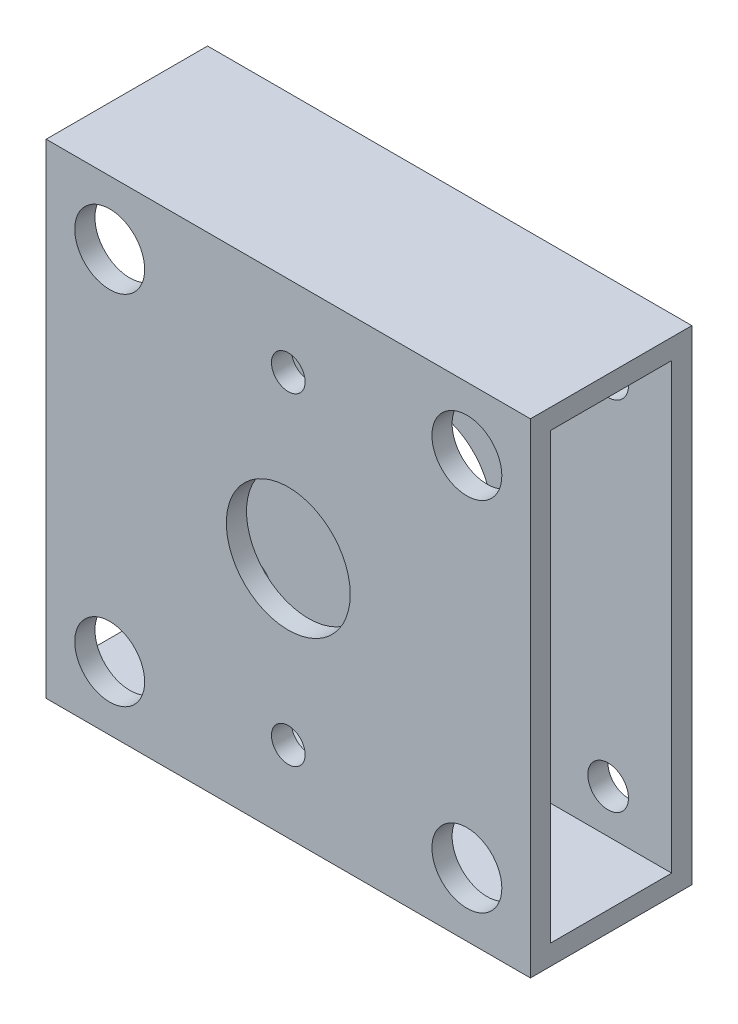
ISO-10303-21;
HEADER;
FILE_DESCRIPTION(('STEP AP214'),'2;1');
FILE_NAME('part.step','',(''),(''),'','','');
FILE_SCHEMA(('AUTOMOTIVE_DESIGN { 1 0 10303 214 1 1 1 1 }'));
ENDSEC;
DATA;
#1=APPLICATION_CONTEXT('core data for automotive mechanical design processes');
#2=APPLICATION_PROTOCOL_DEFINITION('international standard','automotive_design',2000,#1);
#3=PRODUCT_CONTEXT('',#1,'mechanical');
#4=PRODUCT('Part','Part','',(#3));
#5=PRODUCT_RELATED_PRODUCT_CATEGORY('part','',(#4));
#6=PRODUCT_DEFINITION_FORMATION('','',#4);
#7=PRODUCT_DEFINITION_CONTEXT('part definition',#1,'design');
#8=PRODUCT_DEFINITION('design','',#6,#7);
#9=PRODUCT_DEFINITION_SHAPE('','',#8);
#10=(LENGTH_UNIT() NAMED_UNIT(*) SI_UNIT(.MILLI.,.METRE.));
#11=(NAMED_UNIT(*) PLANE_ANGLE_UNIT() SI_UNIT($,.RADIAN.));
#12=(NAMED_UNIT(*) SI_UNIT($,.STERADIAN.) SOLID_ANGLE_UNIT());
#13=UNCERTAINTY_MEASURE_WITH_UNIT(LENGTH_MEASURE(1.E-05),#10,'distance_accuracy_value','');
#14=(GEOMETRIC_REPRESENTATION_CONTEXT(3) GLOBAL_UNCERTAINTY_ASSIGNED_CONTEXT((#13)) GLOBAL_UNIT_ASSIGNED_CONTEXT((#10,
#11,#12)) REPRESENTATION_CONTEXT('',''));
#15=CARTESIAN_POINT('',(0.,0.,0.));
#16=DIRECTION('',(0.,0.,1.));
#17=DIRECTION('',(1.,0.,0.));
#18=AXIS2_PLACEMENT_3D('',#15,#16,#17);
#19=CARTESIAN_POINT('',(38.1,-38.1,12.7));
#20=DIRECTION('',(-1.,0.,0.));
#21=DIRECTION('',(0.,0.,1.));
#22=AXIS2_PLACEMENT_3D('',#19,#20,#21);
#23=PLANE('',#22);
#24=DIRECTION('',(0.,1.,0.));
#25=VECTOR('',#24,1.);
#26=CARTESIAN_POINT('',(38.1,-34.925,-9.525));
#27=LINE('',#26,#25);
#28=CARTESIAN_POINT('',(38.1,-34.925,-9.525));
#29=VERTEX_POINT('',#28);
#30=CARTESIAN_POINT('',(38.1,34.925,-9.525));
#31=VERTEX_POINT('',#30);
#32=EDGE_CURVE('E130',#29,#31,#27,.T.);
#33=ORIENTED_EDGE('',*,*,#32,.F.);
#34=DIRECTION('',(0.,0.,-1.));
#35=VECTOR('',#34,1.);
#36=CARTESIAN_POINT('',(38.1,-34.925,9.525));
#37=LINE('',#36,#35);
#38=CARTESIAN_POINT('',(38.1,-34.925,9.525));
#39=VERTEX_POINT('',#38);
#40=EDGE_CURVE('E50',#39,#29,#37,.T.);
#41=ORIENTED_EDGE('',*,*,#40,.F.);
#42=DIRECTION('',(0.,-1.,0.));
#43=VECTOR('',#42,1.);
#44=CARTESIAN_POINT('',(38.1,34.925,9.525));
#45=LINE('',#44,#43);
#46=CARTESIAN_POINT('',(38.1,34.925,9.525));
#47=VERTEX_POINT('',#46);
#48=EDGE_CURVE('E118',#47,#39,#45,.T.);
#49=ORIENTED_EDGE('',*,*,#48,.F.);
#50=DIRECTION('',(0.,0.,1.));
#51=VECTOR('',#50,1.);
#52=CARTESIAN_POINT('',(38.1,34.925,-9.525));
#53=LINE('',#52,#51);
#54=EDGE_CURVE('E121',#31,#47,#53,.T.);
#55=ORIENTED_EDGE('',*,*,#54,.F.);
#56=EDGE_LOOP('',(#33,#41,#49,#55));
#57=FACE_BOUND('',#56,.T.);
#58=DIRECTION('',(0.,1.,0.));
#59=VECTOR('',#58,1.);
#60=CARTESIAN_POINT('',(38.1,-38.1,-12.7));
#61=LINE('',#60,#59);
#62=CARTESIAN_POINT('',(38.1,-38.1,-12.7));
#63=VERTEX_POINT('',#62);
#64=CARTESIAN_POINT('',(38.1,38.1,-12.7));
#65=VERTEX_POINT('',#64);
#66=EDGE_CURVE('E136',#63,#65,#61,.T.);
#67=ORIENTED_EDGE('',*,*,#66,.T.);
#68=DIRECTION('',(0.,0.,-1.));
#69=VECTOR('',#68,1.);
#70=CARTESIAN_POINT('',(38.1,38.1,12.7));
#71=LINE('',#70,#69);
#72=CARTESIAN_POINT('',(38.1,38.1,12.7));
#73=VERTEX_POINT('',#72);
#74=EDGE_CURVE('E11',#73,#65,#71,.T.);
#75=ORIENTED_EDGE('',*,*,#74,.F.);
#76=DIRECTION('',(0.,1.,0.));
#77=VECTOR('',#76,1.);
#78=CARTESIAN_POINT('',(38.1,-38.1,12.7));
#79=LINE('',#78,#77);
#80=CARTESIAN_POINT('',(38.1,-38.1,12.7));
#81=VERTEX_POINT('',#80);
#82=EDGE_CURVE('E140',#81,#73,#79,.T.);
#83=ORIENTED_EDGE('',*,*,#82,.F.);
#84=DIRECTION('',(0.,0.,-1.));
#85=VECTOR('',#84,1.);
#86=CARTESIAN_POINT('',(38.1,-38.1,12.7));
#87=LINE('',#86,#85);
#88=EDGE_CURVE('E150',#81,#63,#87,.T.);
#89=ORIENTED_EDGE('',*,*,#88,.T.);
#90=EDGE_LOOP('',(#67,#75,#83,#89));
#91=FACE_BOUND('',#90,.T.);
#92=ADVANCED_FACE('F34',(#57,#91),#23,.F.);
#93=CARTESIAN_POINT('',(-38.1,38.1,12.7));
#94=DIRECTION('',(0.,-1.,0.));
#95=DIRECTION('',(0.,0.,-1.));
#96=AXIS2_PLACEMENT_3D('',#93,#94,#95);
#97=PLANE('',#96);
#98=DIRECTION('',(-1.,0.,0.));
#99=VECTOR('',#98,1.);
#100=CARTESIAN_POINT('',(-38.1,38.1,-12.7));
#101=LINE('',#100,#99);
#102=CARTESIAN_POINT('',(-38.1,38.1,-12.7));
#103=VERTEX_POINT('',#102);
#104=EDGE_CURVE('E153',#65,#103,#101,.T.);
#105=ORIENTED_EDGE('',*,*,#104,.T.);
#106=DIRECTION('',(0.,0.,-1.));
#107=VECTOR('',#106,1.);
#108=CARTESIAN_POINT('',(-38.1,38.1,12.7));
#109=LINE('',#108,#107);
#110=CARTESIAN_POINT('',(-38.1,38.1,12.7));
#111=VERTEX_POINT('',#110);
#112=EDGE_CURVE('E42',#111,#103,#109,.T.);
#113=ORIENTED_EDGE('',*,*,#112,.F.);
#114=DIRECTION('',(-1.,0.,0.));
#115=VECTOR('',#114,1.);
#116=CARTESIAN_POINT('',(-38.1,38.1,12.7));
#117=LINE('',#116,#115);
#118=EDGE_CURVE('E143',#73,#111,#117,.T.);
#119=ORIENTED_EDGE('',*,*,#118,.F.);
#120=ORIENTED_EDGE('',*,*,#74,.T.);
#121=EDGE_LOOP('',(#105,#113,#119,#120));
#122=FACE_BOUND('',#121,.T.);
#123=ADVANCED_FACE('F264',(#122),#97,.F.);
#124=CARTESIAN_POINT('',(-38.1,-38.1,12.7));
#125=DIRECTION('',(1.,0.,0.));
#126=DIRECTION('',(0.,0.,-1.));
#127=AXIS2_PLACEMENT_3D('',#124,#125,#126);
#128=PLANE('',#127);
#129=DIRECTION('',(0.,-1.,0.));
#130=VECTOR('',#129,1.);
#131=CARTESIAN_POINT('',(-38.1,34.925,9.525));
#132=LINE('',#131,#130);
#133=CARTESIAN_POINT('',(-38.1,34.925,9.525));
#134=VERTEX_POINT('',#133);
#135=CARTESIAN_POINT('',(-38.1,-34.925,9.525));
#136=VERTEX_POINT('',#135);
#137=EDGE_CURVE('E108',#134,#136,#132,.T.);
#138=ORIENTED_EDGE('',*,*,#137,.T.);
#139=DIRECTION('',(0.,0.,-1.));
#140=VECTOR('',#139,1.);
#141=CARTESIAN_POINT('',(-38.1,-34.925,9.525));
#142=LINE('',#141,#140);
#143=CARTESIAN_POINT('',(-38.1,-34.925,-9.525));
#144=VERTEX_POINT('',#143);
#145=EDGE_CURVE('E102',#136,#144,#142,.T.);
#146=ORIENTED_EDGE('',*,*,#145,.T.);
#147=DIRECTION('',(0.,1.,0.));
#148=VECTOR('',#147,1.);
#149=CARTESIAN_POINT('',(-38.1,-34.925,-9.525));
#150=LINE('',#149,#148);
#151=CARTESIAN_POINT('',(-38.1,34.925,-9.525));
#152=VERTEX_POINT('',#151);
#153=EDGE_CURVE('E111',#144,#152,#150,.T.);
#154=ORIENTED_EDGE('',*,*,#153,.T.);
#155=DIRECTION('',(0.,0.,1.));
#156=VECTOR('',#155,1.);
#157=CARTESIAN_POINT('',(-38.1,34.925,-9.525));
#158=LINE('',#157,#156);
#159=EDGE_CURVE('E58',#152,#134,#158,.T.);
#160=ORIENTED_EDGE('',*,*,#159,.T.);
#161=EDGE_LOOP('',(#138,#146,#154,#160));
#162=FACE_BOUND('',#161,.T.);
#163=DIRECTION('',(0.,-1.,0.));
#164=VECTOR('',#163,1.);
#165=CARTESIAN_POINT('',(-38.1,-38.1,-12.7));
#166=LINE('',#165,#164);
#167=CARTESIAN_POINT('',(-38.1,-38.1,-12.7));
#168=VERTEX_POINT('',#167);
#169=EDGE_CURVE('E155',#103,#168,#166,.T.);
#170=ORIENTED_EDGE('',*,*,#169,.T.);
#171=DIRECTION('',(0.,0.,-1.));
#172=VECTOR('',#171,1.);
#173=CARTESIAN_POINT('',(-38.1,-38.1,12.7));
#174=LINE('',#173,#172);
#175=CARTESIAN_POINT('',(-38.1,-38.1,12.7));
#176=VERTEX_POINT('',#175);
#177=EDGE_CURVE('E160',#176,#168,#174,.T.);
#178=ORIENTED_EDGE('',*,*,#177,.F.);
#179=DIRECTION('',(0.,-1.,0.));
#180=VECTOR('',#179,1.);
#181=CARTESIAN_POINT('',(-38.1,-38.1,12.7));
#182=LINE('',#181,#180);
#183=EDGE_CURVE('E146',#111,#176,#182,.T.);
#184=ORIENTED_EDGE('',*,*,#183,.F.);
#185=ORIENTED_EDGE('',*,*,#112,.T.);
#186=EDGE_LOOP('',(#170,#178,#184,#185));
#187=FACE_BOUND('',#186,.T.);
#188=ADVANCED_FACE('F115',(#162,#187),#128,.F.);
#189=CARTESIAN_POINT('',(-38.1,-38.1,12.7));
#190=DIRECTION('',(0.,1.,0.));
#191=DIRECTION('',(0.,0.,1.));
#192=AXIS2_PLACEMENT_3D('',#189,#190,#191);
#193=PLANE('',#192);
#194=DIRECTION('',(1.,0.,0.));
#195=VECTOR('',#194,1.);
#196=CARTESIAN_POINT('',(-38.1,-38.1,-12.7));
#197=LINE('',#196,#195);
#198=EDGE_CURVE('E144',#168,#63,#197,.T.);
#199=ORIENTED_EDGE('',*,*,#198,.T.);
#200=ORIENTED_EDGE('',*,*,#88,.F.);
#201=DIRECTION('',(1.,0.,0.));
#202=VECTOR('',#201,1.);
#203=CARTESIAN_POINT('',(-38.1,-38.1,12.7));
#204=LINE('',#203,#202);
#205=EDGE_CURVE('E148',#176,#81,#204,.T.);
#206=ORIENTED_EDGE('',*,*,#205,.F.);
#207=ORIENTED_EDGE('',*,*,#177,.T.);
#208=EDGE_LOOP('',(#199,#200,#206,#207));
#209=FACE_BOUND('',#208,.T.);
#210=ADVANCED_FACE('F254',(#209),#193,.F.);
#211=CARTESIAN_POINT('',(0.,0.,12.7));
#212=DIRECTION('',(0.,0.,-1.));
#213=DIRECTION('',(-1.,0.,0.));
#214=AXIS2_PLACEMENT_3D('',#211,#212,#213);
#215=PLANE('',#214);
#216=CARTESIAN_POINT('',(0.,-25.4,12.7));
#217=DIRECTION('',(0.,0.,-1.));
#218=DIRECTION('',(-1.,0.,0.));
#219=AXIS2_PLACEMENT_3D('',#216,#217,#218);
#220=CIRCLE('',#219,2.64999999999999);
#221=CARTESIAN_POINT('',(-2.64999999999999,-25.4,12.7));
#222=VERTEX_POINT('',#221);
#223=EDGE_CURVE('E210',#222,#222,#220,.T.);
#224=ORIENTED_EDGE('',*,*,#223,.T.);
#225=EDGE_LOOP('',(#224));
#226=FACE_BOUND('',#225,.T.);
#227=CARTESIAN_POINT('',(0.,25.4,12.7));
#228=DIRECTION('',(0.,0.,-1.));
#229=DIRECTION('',(-1.,0.,0.));
#230=AXIS2_PLACEMENT_3D('',#227,#228,#229);
#231=CIRCLE('',#230,2.64999999999999);
#232=CARTESIAN_POINT('',(-2.64999999999999,25.4,12.7));
#233=VERTEX_POINT('',#232);
#234=EDGE_CURVE('E205',#233,#233,#231,.T.);
#235=ORIENTED_EDGE('',*,*,#234,.T.);
#236=EDGE_LOOP('',(#235));
#237=FACE_BOUND('',#236,.T.);
#238=CARTESIAN_POINT('',(-28.1,28.1,12.7));
#239=DIRECTION('',(0.,0.,1.));
#240=DIRECTION('',(1.,0.,0.));
#241=AXIS2_PLACEMENT_3D('',#238,#239,#240);
#242=CIRCLE('',#241,5.5);
#243=CARTESIAN_POINT('',(-22.6,28.1,12.7));
#244=VERTEX_POINT('',#243);
#245=EDGE_CURVE('E207',#244,#244,#242,.T.);
#246=ORIENTED_EDGE('',*,*,#245,.F.);
#247=EDGE_LOOP('',(#246));
#248=FACE_BOUND('',#247,.T.);
#249=CARTESIAN_POINT('',(28.1,28.1,12.7));
#250=DIRECTION('',(0.,0.,1.));
#251=DIRECTION('',(1.,0.,0.));
#252=AXIS2_PLACEMENT_3D('',#249,#250,#251);
#253=CIRCLE('',#252,5.5);
#254=CARTESIAN_POINT('',(33.6,28.1,12.7));
#255=VERTEX_POINT('',#254);
#256=EDGE_CURVE('E200',#255,#255,#253,.T.);
#257=ORIENTED_EDGE('',*,*,#256,.F.);
#258=EDGE_LOOP('',(#257));
#259=FACE_BOUND('',#258,.T.);
#260=CARTESIAN_POINT('',(28.1,-28.1,12.7));
#261=DIRECTION('',(0.,0.,1.));
#262=DIRECTION('',(1.,0.,0.));
#263=AXIS2_PLACEMENT_3D('',#260,#261,#262);
#264=CIRCLE('',#263,5.5);
#265=CARTESIAN_POINT('',(33.6,-28.1,12.7));
#266=VERTEX_POINT('',#265);
#267=EDGE_CURVE('E192',#266,#266,#264,.T.);
#268=ORIENTED_EDGE('',*,*,#267,.F.);
#269=EDGE_LOOP('',(#268));
#270=FACE_BOUND('',#269,.T.);
#271=CARTESIAN_POINT('',(-28.1,-28.1,12.7));
#272=DIRECTION('',(0.,0.,1.));
#273=DIRECTION('',(1.,0.,0.));
#274=AXIS2_PLACEMENT_3D('',#271,#272,#273);
#275=CIRCLE('',#274,5.5);
#276=CARTESIAN_POINT('',(-22.6,-28.1,12.7));
#277=VERTEX_POINT('',#276);
#278=EDGE_CURVE('E184',#277,#277,#275,.T.);
#279=ORIENTED_EDGE('',*,*,#278,.F.);
#280=EDGE_LOOP('',(#279));
#281=FACE_BOUND('',#280,.T.);
#282=CARTESIAN_POINT('',(0.,0.,12.7));
#283=DIRECTION('',(0.,0.,1.));
#284=DIRECTION('',(1.,0.,0.));
#285=AXIS2_PLACEMENT_3D('',#282,#283,#284);
#286=CIRCLE('',#285,9.75);
#287=CARTESIAN_POINT('',(9.75,0.,12.7));
#288=VERTEX_POINT('',#287);
#289=EDGE_CURVE('E176',#288,#288,#286,.T.);
#290=ORIENTED_EDGE('',*,*,#289,.F.);
#291=EDGE_LOOP('',(#290));
#292=FACE_BOUND('',#291,.T.);
#293=ORIENTED_EDGE('',*,*,#82,.T.);
#294=ORIENTED_EDGE('',*,*,#118,.T.);
#295=ORIENTED_EDGE('',*,*,#183,.T.);
#296=ORIENTED_EDGE('',*,*,#205,.T.);
#297=EDGE_LOOP('',(#293,#294,#295,#296));
#298=FACE_BOUND('',#297,.T.);
#299=ADVANCED_FACE('F250',(#226,#237,#248,#259,#270,#281,#292,#298),#215,.F.);
#300=CARTESIAN_POINT('',(0.,0.,-12.7));
#301=DIRECTION('',(0.,0.,-1.));
#302=DIRECTION('',(-1.,0.,0.));
#303=AXIS2_PLACEMENT_3D('',#300,#301,#302);
#304=PLANE('',#303);
#305=CARTESIAN_POINT('',(0.,-25.4,-12.7));
#306=DIRECTION('',(0.,0.,-1.));
#307=DIRECTION('',(-1.,0.,0.));
#308=AXIS2_PLACEMENT_3D('',#305,#306,#307);
#309=CIRCLE('',#308,5.);
#310=CARTESIAN_POINT('',(-5.,-25.4,-12.7));
#311=VERTEX_POINT('',#310);
#312=EDGE_CURVE('E216',#311,#311,#309,.T.);
#313=ORIENTED_EDGE('',*,*,#312,.F.);
#314=EDGE_LOOP('',(#313));
#315=FACE_BOUND('',#314,.T.);
#316=CARTESIAN_POINT('',(0.,25.4,-12.7));
#317=DIRECTION('',(0.,0.,-1.));
#318=DIRECTION('',(-1.,0.,0.));
#319=AXIS2_PLACEMENT_3D('',#316,#317,#318);
#320=CIRCLE('',#319,5.);
#321=CARTESIAN_POINT('',(-5.,25.4,-12.7));
#322=VERTEX_POINT('',#321);
#323=EDGE_CURVE('E214',#322,#322,#320,.T.);
#324=ORIENTED_EDGE('',*,*,#323,.F.);
#325=EDGE_LOOP('',(#324));
#326=FACE_BOUND('',#325,.T.);
#327=CARTESIAN_POINT('',(-28.1,28.1,-12.7));
#328=DIRECTION('',(0.,0.,1.));
#329=DIRECTION('',(1.,0.,0.));
#330=AXIS2_PLACEMENT_3D('',#327,#328,#329);
#331=CIRCLE('',#330,3.19999999999999);
#332=CARTESIAN_POINT('',(-24.9,28.1,-12.7));
#333=VERTEX_POINT('',#332);
#334=EDGE_CURVE('E197',#333,#333,#331,.T.);
#335=ORIENTED_EDGE('',*,*,#334,.T.);
#336=EDGE_LOOP('',(#335));
#337=FACE_BOUND('',#336,.T.);
#338=CARTESIAN_POINT('',(28.1,28.1,-12.7));
#339=DIRECTION('',(0.,0.,1.));
#340=DIRECTION('',(1.,0.,0.));
#341=AXIS2_PLACEMENT_3D('',#338,#339,#340);
#342=CIRCLE('',#341,3.19999999999999);
#343=CARTESIAN_POINT('',(31.3,28.1,-12.7));
#344=VERTEX_POINT('',#343);
#345=EDGE_CURVE('E189',#344,#344,#342,.T.);
#346=ORIENTED_EDGE('',*,*,#345,.T.);
#347=EDGE_LOOP('',(#346));
#348=FACE_BOUND('',#347,.T.);
#349=CARTESIAN_POINT('',(28.1,-28.1,-12.7));
#350=DIRECTION('',(0.,0.,1.));
#351=DIRECTION('',(1.,0.,0.));
#352=AXIS2_PLACEMENT_3D('',#349,#350,#351);
#353=CIRCLE('',#352,3.19999999999999);
#354=CARTESIAN_POINT('',(31.3,-28.1,-12.7));
#355=VERTEX_POINT('',#354);
#356=EDGE_CURVE('E181',#355,#355,#353,.T.);
#357=ORIENTED_EDGE('',*,*,#356,.T.);
#358=EDGE_LOOP('',(#357));
#359=FACE_BOUND('',#358,.T.);
#360=CARTESIAN_POINT('',(-28.1,-28.1,-12.7));
#361=DIRECTION('',(0.,0.,1.));
#362=DIRECTION('',(1.,0.,0.));
#363=AXIS2_PLACEMENT_3D('',#360,#361,#362);
#364=CIRCLE('',#363,3.19999999999999);
#365=CARTESIAN_POINT('',(-24.9,-28.1,-12.7));
#366=VERTEX_POINT('',#365);
#367=EDGE_CURVE('E173',#366,#366,#364,.T.);
#368=ORIENTED_EDGE('',*,*,#367,.T.);
#369=EDGE_LOOP('',(#368));
#370=FACE_BOUND('',#369,.T.);
#371=CARTESIAN_POINT('',(0.,0.,-12.7));
#372=DIRECTION('',(0.,0.,1.));
#373=DIRECTION('',(1.,0.,0.));
#374=AXIS2_PLACEMENT_3D('',#371,#372,#373);
#375=CIRCLE('',#374,9.75);
#376=CARTESIAN_POINT('',(9.75,0.,-12.7));
#377=VERTEX_POINT('',#376);
#378=EDGE_CURVE('E168',#377,#377,#375,.T.);
#379=ORIENTED_EDGE('',*,*,#378,.T.);
#380=EDGE_LOOP('',(#379));
#381=FACE_BOUND('',#380,.T.);
#382=ORIENTED_EDGE('',*,*,#66,.F.);
#383=ORIENTED_EDGE('',*,*,#198,.F.);
#384=ORIENTED_EDGE('',*,*,#169,.F.);
#385=ORIENTED_EDGE('',*,*,#104,.F.);
#386=EDGE_LOOP('',(#382,#383,#384,#385));
#387=FACE_BOUND('',#386,.T.);
#388=ADVANCED_FACE('F253',(#315,#326,#337,#348,#359,#370,#381,#387),#304,.T.);
#389=CARTESIAN_POINT('',(-38.1,-34.925,9.525));
#390=DIRECTION('',(0.,-1.,0.));
#391=DIRECTION('',(0.,0.,-1.));
#392=AXIS2_PLACEMENT_3D('',#389,#390,#391);
#393=PLANE('',#392);
#394=ORIENTED_EDGE('',*,*,#40,.T.);
#395=DIRECTION('',(1.,0.,0.));
#396=VECTOR('',#395,1.);
#397=CARTESIAN_POINT('',(-38.1,-34.925,-9.525));
#398=LINE('',#397,#396);
#399=EDGE_CURVE('E98',#144,#29,#398,.T.);
#400=ORIENTED_EDGE('',*,*,#399,.F.);
#401=ORIENTED_EDGE('',*,*,#145,.F.);
#402=DIRECTION('',(1.,0.,0.));
#403=VECTOR('',#402,1.);
#404=CARTESIAN_POINT('',(-38.1,-34.925,9.525));
#405=LINE('',#404,#403);
#406=EDGE_CURVE('E134',#136,#39,#405,.T.);
#407=ORIENTED_EDGE('',*,*,#406,.T.);
#408=EDGE_LOOP('',(#394,#400,#401,#407));
#409=FACE_BOUND('',#408,.T.);
#410=ADVANCED_FACE('F100',(#409),#393,.F.);
#411=CARTESIAN_POINT('',(-38.1,34.925,9.525));
#412=DIRECTION('',(0.,0.,1.));
#413=DIRECTION('',(1.,0.,0.));
#414=AXIS2_PLACEMENT_3D('',#411,#412,#413);
#415=PLANE('',#414);
#416=CARTESIAN_POINT('',(0.,-25.4,9.525));
#417=DIRECTION('',(0.,0.,1.));
#418=DIRECTION('',(1.,0.,0.));
#419=AXIS2_PLACEMENT_3D('',#416,#417,#418);
#420=CIRCLE('',#419,2.65);
#421=CARTESIAN_POINT('',(2.65,-25.4,9.525));
#422=VERTEX_POINT('',#421);
#423=EDGE_CURVE('E37',#422,#422,#420,.T.);
#424=ORIENTED_EDGE('',*,*,#423,.T.);
#425=EDGE_LOOP('',(#424));
#426=FACE_BOUND('',#425,.T.);
#427=CARTESIAN_POINT('',(0.,25.4,9.525));
#428=DIRECTION('',(0.,0.,1.));
#429=DIRECTION('',(1.,0.,0.));
#430=AXIS2_PLACEMENT_3D('',#427,#428,#429);
#431=CIRCLE('',#430,2.65);
#432=CARTESIAN_POINT('',(2.65,25.4,9.525));
#433=VERTEX_POINT('',#432);
#434=EDGE_CURVE('E204',#433,#433,#431,.T.);
#435=ORIENTED_EDGE('',*,*,#434,.T.);
#436=EDGE_LOOP('',(#435));
#437=FACE_BOUND('',#436,.T.);
#438=CARTESIAN_POINT('',(-28.1,28.1,9.525));
#439=DIRECTION('',(0.,0.,1.));
#440=DIRECTION('',(1.,0.,0.));
#441=AXIS2_PLACEMENT_3D('',#438,#439,#440);
#442=CIRCLE('',#441,5.5);
#443=CARTESIAN_POINT('',(-22.6,28.1,9.525));
#444=VERTEX_POINT('',#443);
#445=EDGE_CURVE('E196',#444,#444,#442,.T.);
#446=ORIENTED_EDGE('',*,*,#445,.T.);
#447=EDGE_LOOP('',(#446));
#448=FACE_BOUND('',#447,.T.);
#449=CARTESIAN_POINT('',(28.1,28.1,9.525));
#450=DIRECTION('',(0.,0.,1.));
#451=DIRECTION('',(1.,0.,0.));
#452=AXIS2_PLACEMENT_3D('',#449,#450,#451);
#453=CIRCLE('',#452,5.5);
#454=CARTESIAN_POINT('',(33.6,28.1,9.525));
#455=VERTEX_POINT('',#454);
#456=EDGE_CURVE('E188',#455,#455,#453,.T.);
#457=ORIENTED_EDGE('',*,*,#456,.T.);
#458=EDGE_LOOP('',(#457));
#459=FACE_BOUND('',#458,.T.);
#460=CARTESIAN_POINT('',(28.1,-28.1,9.525));
#461=DIRECTION('',(0.,0.,1.));
#462=DIRECTION('',(1.,0.,0.));
#463=AXIS2_PLACEMENT_3D('',#460,#461,#462);
#464=CIRCLE('',#463,5.5);
#465=CARTESIAN_POINT('',(33.6,-28.1,9.525));
#466=VERTEX_POINT('',#465);
#467=EDGE_CURVE('E180',#466,#466,#464,.T.);
#468=ORIENTED_EDGE('',*,*,#467,.T.);
#469=EDGE_LOOP('',(#468));
#470=FACE_BOUND('',#469,.T.);
#471=CARTESIAN_POINT('',(-28.1,-28.1,9.525));
#472=DIRECTION('',(0.,0.,1.));
#473=DIRECTION('',(1.,0.,0.));
#474=AXIS2_PLACEMENT_3D('',#471,#472,#473);
#475=CIRCLE('',#474,5.5);
#476=CARTESIAN_POINT('',(-22.6,-28.1,9.525));
#477=VERTEX_POINT('',#476);
#478=EDGE_CURVE('E172',#477,#477,#475,.T.);
#479=ORIENTED_EDGE('',*,*,#478,.T.);
#480=EDGE_LOOP('',(#479));
#481=FACE_BOUND('',#480,.T.);
#482=CARTESIAN_POINT('',(0.,0.,9.525));
#483=DIRECTION('',(0.,0.,1.));
#484=DIRECTION('',(1.,0.,0.));
#485=AXIS2_PLACEMENT_3D('',#482,#483,#484);
#486=CIRCLE('',#485,9.75);
#487=CARTESIAN_POINT('',(9.75,0.,9.525));
#488=VERTEX_POINT('',#487);
#489=EDGE_CURVE('E124',#488,#488,#486,.T.);
#490=ORIENTED_EDGE('',*,*,#489,.T.);
#491=EDGE_LOOP('',(#490));
#492=FACE_BOUND('',#491,.T.);
#493=ORIENTED_EDGE('',*,*,#48,.T.);
#494=ORIENTED_EDGE('',*,*,#406,.F.);
#495=ORIENTED_EDGE('',*,*,#137,.F.);
#496=DIRECTION('',(1.,0.,0.));
#497=VECTOR('',#496,1.);
#498=CARTESIAN_POINT('',(-38.1,34.925,9.525));
#499=LINE('',#498,#497);
#500=EDGE_CURVE('E137',#134,#47,#499,.T.);
#501=ORIENTED_EDGE('',*,*,#500,.T.);
#502=EDGE_LOOP('',(#493,#494,#495,#501));
#503=FACE_BOUND('',#502,.T.);
#504=ADVANCED_FACE('F278',(#426,#437,#448,#459,#470,#481,#492,#503),#415,.F.);
#505=CARTESIAN_POINT('',(-38.1,34.925,-9.525));
#506=DIRECTION('',(0.,1.,0.));
#507=DIRECTION('',(0.,0.,1.));
#508=AXIS2_PLACEMENT_3D('',#505,#506,#507);
#509=PLANE('',#508);
#510=ORIENTED_EDGE('',*,*,#54,.T.);
#511=ORIENTED_EDGE('',*,*,#500,.F.);
#512=ORIENTED_EDGE('',*,*,#159,.F.);
#513=DIRECTION('',(1.,0.,0.));
#514=VECTOR('',#513,1.);
#515=CARTESIAN_POINT('',(-38.1,34.925,-9.525));
#516=LINE('',#515,#514);
#517=EDGE_CURVE('E107',#152,#31,#516,.T.);
#518=ORIENTED_EDGE('',*,*,#517,.T.);
#519=EDGE_LOOP('',(#510,#511,#512,#518));
#520=FACE_BOUND('',#519,.T.);
#521=ADVANCED_FACE('F292',(#520),#509,.F.);
#522=CARTESIAN_POINT('',(-38.1,-34.925,-9.525));
#523=DIRECTION('',(0.,0.,-1.));
#524=DIRECTION('',(-1.,0.,0.));
#525=AXIS2_PLACEMENT_3D('',#522,#523,#524);
#526=PLANE('',#525);
#527=CARTESIAN_POINT('',(0.,-25.4,-9.525));
#528=DIRECTION('',(0.,0.,-1.));
#529=DIRECTION('',(-1.,0.,0.));
#530=AXIS2_PLACEMENT_3D('',#527,#528,#529);
#531=CIRCLE('',#530,5.);
#532=CARTESIAN_POINT('',(-5.,-25.4,-9.525));
#533=VERTEX_POINT('',#532);
#534=EDGE_CURVE('E208',#533,#533,#531,.T.);
#535=ORIENTED_EDGE('',*,*,#534,.T.);
#536=EDGE_LOOP('',(#535));
#537=FACE_BOUND('',#536,.T.);
#538=CARTESIAN_POINT('',(0.,25.4,-9.525));
#539=DIRECTION('',(0.,0.,-1.));
#540=DIRECTION('',(-1.,0.,0.));
#541=AXIS2_PLACEMENT_3D('',#538,#539,#540);
#542=CIRCLE('',#541,5.);
#543=CARTESIAN_POINT('',(-5.,25.4,-9.525));
#544=VERTEX_POINT('',#543);
#545=EDGE_CURVE('E201',#544,#544,#542,.T.);
#546=ORIENTED_EDGE('',*,*,#545,.T.);
#547=EDGE_LOOP('',(#546));
#548=FACE_BOUND('',#547,.T.);
#549=CARTESIAN_POINT('',(-28.1,28.1,-9.525));
#550=DIRECTION('',(0.,0.,-1.));
#551=DIRECTION('',(-1.,0.,0.));
#552=AXIS2_PLACEMENT_3D('',#549,#550,#551);
#553=CIRCLE('',#552,3.2);
#554=CARTESIAN_POINT('',(-31.3,28.1,-9.525));
#555=VERTEX_POINT('',#554);
#556=EDGE_CURVE('E193',#555,#555,#553,.T.);
#557=ORIENTED_EDGE('',*,*,#556,.T.);
#558=EDGE_LOOP('',(#557));
#559=FACE_BOUND('',#558,.T.);
#560=CARTESIAN_POINT('',(28.1,28.1,-9.525));
#561=DIRECTION('',(0.,0.,-1.));
#562=DIRECTION('',(-1.,0.,0.));
#563=AXIS2_PLACEMENT_3D('',#560,#561,#562);
#564=CIRCLE('',#563,3.2);
#565=CARTESIAN_POINT('',(24.9,28.1,-9.525));
#566=VERTEX_POINT('',#565);
#567=EDGE_CURVE('E185',#566,#566,#564,.T.);
#568=ORIENTED_EDGE('',*,*,#567,.T.);
#569=EDGE_LOOP('',(#568));
#570=FACE_BOUND('',#569,.T.);
#571=CARTESIAN_POINT('',(28.1,-28.1,-9.525));
#572=DIRECTION('',(0.,0.,-1.));
#573=DIRECTION('',(-1.,0.,0.));
#574=AXIS2_PLACEMENT_3D('',#571,#572,#573);
#575=CIRCLE('',#574,3.2);
#576=CARTESIAN_POINT('',(24.9,-28.1,-9.525));
#577=VERTEX_POINT('',#576);
#578=EDGE_CURVE('E177',#577,#577,#575,.T.);
#579=ORIENTED_EDGE('',*,*,#578,.T.);
#580=EDGE_LOOP('',(#579));
#581=FACE_BOUND('',#580,.T.);
#582=CARTESIAN_POINT('',(-28.1,-28.1,-9.525));
#583=DIRECTION('',(0.,0.,-1.));
#584=DIRECTION('',(-1.,0.,0.));
#585=AXIS2_PLACEMENT_3D('',#582,#583,#584);
#586=CIRCLE('',#585,3.2);
#587=CARTESIAN_POINT('',(-31.3,-28.1,-9.525));
#588=VERTEX_POINT('',#587);
#589=EDGE_CURVE('E169',#588,#588,#586,.T.);
#590=ORIENTED_EDGE('',*,*,#589,.T.);
#591=EDGE_LOOP('',(#590));
#592=FACE_BOUND('',#591,.T.);
#593=CARTESIAN_POINT('',(0.,0.,-9.525));
#594=DIRECTION('',(0.,0.,-1.));
#595=DIRECTION('',(-1.,0.,0.));
#596=AXIS2_PLACEMENT_3D('',#593,#594,#595);
#597=CIRCLE('',#596,9.75);
#598=CARTESIAN_POINT('',(-9.75,0.,-9.525));
#599=VERTEX_POINT('',#598);
#600=EDGE_CURVE('E165',#599,#599,#597,.T.);
#601=ORIENTED_EDGE('',*,*,#600,.T.);
#602=EDGE_LOOP('',(#601));
#603=FACE_BOUND('',#602,.T.);
#604=ORIENTED_EDGE('',*,*,#32,.T.);
#605=ORIENTED_EDGE('',*,*,#517,.F.);
#606=ORIENTED_EDGE('',*,*,#153,.F.);
#607=ORIENTED_EDGE('',*,*,#399,.T.);
#608=EDGE_LOOP('',(#604,#605,#606,#607));
#609=FACE_BOUND('',#608,.T.);
#610=ADVANCED_FACE('F112',(#537,#548,#559,#570,#581,#592,#603,#609),#526,.F.);
#611=CARTESIAN_POINT('',(0.,0.,-12.7));
#612=DIRECTION('',(0.,0.,1.));
#613=DIRECTION('',(1.,0.,0.));
#614=AXIS2_PLACEMENT_3D('',#611,#612,#613);
#615=CYLINDRICAL_SURFACE('',#614,9.75);
#616=ORIENTED_EDGE('',*,*,#378,.F.);
#617=EDGE_LOOP('',(#616));
#618=FACE_BOUND('',#617,.T.);
#619=ORIENTED_EDGE('',*,*,#600,.F.);
#620=EDGE_LOOP('',(#619));
#621=FACE_BOUND('',#620,.T.);
#622=ADVANCED_FACE('F305',(#618,#621),#615,.F.);
#623=ORIENTED_EDGE('',*,*,#289,.T.);
#624=EDGE_LOOP('',(#623));
#625=FACE_BOUND('',#624,.T.);
#626=ORIENTED_EDGE('',*,*,#489,.F.);
#627=EDGE_LOOP('',(#626));
#628=FACE_BOUND('',#627,.T.);
#629=ADVANCED_FACE('F247',(#625,#628),#615,.F.);
#630=CARTESIAN_POINT('',(-28.1,-28.1,12.7));
#631=DIRECTION('',(0.,0.,1.));
#632=DIRECTION('',(1.,0.,0.));
#633=AXIS2_PLACEMENT_3D('',#630,#631,#632);
#634=CYLINDRICAL_SURFACE('',#633,3.2);
#635=ORIENTED_EDGE('',*,*,#367,.F.);
#636=EDGE_LOOP('',(#635));
#637=FACE_BOUND('',#636,.T.);
#638=ORIENTED_EDGE('',*,*,#589,.F.);
#639=EDGE_LOOP('',(#638));
#640=FACE_BOUND('',#639,.T.);
#641=ADVANCED_FACE('F324',(#637,#640),#634,.F.);
#642=CARTESIAN_POINT('',(-28.1,-28.1,12.7));
#643=DIRECTION('',(0.,0.,1.));
#644=DIRECTION('',(1.,0.,0.));
#645=AXIS2_PLACEMENT_3D('',#642,#643,#644);
#646=CYLINDRICAL_SURFACE('',#645,5.5);
#647=ORIENTED_EDGE('',*,*,#278,.T.);
#648=EDGE_LOOP('',(#647));
#649=FACE_BOUND('',#648,.T.);
#650=ORIENTED_EDGE('',*,*,#478,.F.);
#651=EDGE_LOOP('',(#650));
#652=FACE_BOUND('',#651,.T.);
#653=ADVANCED_FACE('F326',(#649,#652),#646,.F.);
#654=CARTESIAN_POINT('',(28.1,-28.1,12.7));
#655=DIRECTION('',(0.,0.,1.));
#656=DIRECTION('',(1.,0.,0.));
#657=AXIS2_PLACEMENT_3D('',#654,#655,#656);
#658=CYLINDRICAL_SURFACE('',#657,3.2);
#659=ORIENTED_EDGE('',*,*,#356,.F.);
#660=EDGE_LOOP('',(#659));
#661=FACE_BOUND('',#660,.T.);
#662=ORIENTED_EDGE('',*,*,#578,.F.);
#663=EDGE_LOOP('',(#662));
#664=FACE_BOUND('',#663,.T.);
#665=ADVANCED_FACE('F332',(#661,#664),#658,.F.);
#666=CARTESIAN_POINT('',(28.1,-28.1,12.7));
#667=DIRECTION('',(0.,0.,1.));
#668=DIRECTION('',(1.,0.,0.));
#669=AXIS2_PLACEMENT_3D('',#666,#667,#668);
#670=CYLINDRICAL_SURFACE('',#669,5.5);
#671=ORIENTED_EDGE('',*,*,#267,.T.);
#672=EDGE_LOOP('',(#671));
#673=FACE_BOUND('',#672,.T.);
#674=ORIENTED_EDGE('',*,*,#467,.F.);
#675=EDGE_LOOP('',(#674));
#676=FACE_BOUND('',#675,.T.);
#677=ADVANCED_FACE('F339',(#673,#676),#670,.F.);
#678=CARTESIAN_POINT('',(28.1,28.1,12.7));
#679=DIRECTION('',(0.,0.,1.));
#680=DIRECTION('',(1.,0.,0.));
#681=AXIS2_PLACEMENT_3D('',#678,#679,#680);
#682=CYLINDRICAL_SURFACE('',#681,3.2);
#683=ORIENTED_EDGE('',*,*,#345,.F.);
#684=EDGE_LOOP('',(#683));
#685=FACE_BOUND('',#684,.T.);
#686=ORIENTED_EDGE('',*,*,#567,.F.);
#687=EDGE_LOOP('',(#686));
#688=FACE_BOUND('',#687,.T.);
#689=ADVANCED_FACE('F343',(#685,#688),#682,.F.);
#690=CARTESIAN_POINT('',(28.1,28.1,12.7));
#691=DIRECTION('',(0.,0.,1.));
#692=DIRECTION('',(1.,0.,0.));
#693=AXIS2_PLACEMENT_3D('',#690,#691,#692);
#694=CYLINDRICAL_SURFACE('',#693,5.5);
#695=ORIENTED_EDGE('',*,*,#256,.T.);
#696=EDGE_LOOP('',(#695));
#697=FACE_BOUND('',#696,.T.);
#698=ORIENTED_EDGE('',*,*,#456,.F.);
#699=EDGE_LOOP('',(#698));
#700=FACE_BOUND('',#699,.T.);
#701=ADVANCED_FACE('F347',(#697,#700),#694,.F.);
#702=CARTESIAN_POINT('',(-28.1,28.1,12.7));
#703=DIRECTION('',(0.,0.,1.));
#704=DIRECTION('',(1.,0.,0.));
#705=AXIS2_PLACEMENT_3D('',#702,#703,#704);
#706=CYLINDRICAL_SURFACE('',#705,3.2);
#707=ORIENTED_EDGE('',*,*,#334,.F.);
#708=EDGE_LOOP('',(#707));
#709=FACE_BOUND('',#708,.T.);
#710=ORIENTED_EDGE('',*,*,#556,.F.);
#711=EDGE_LOOP('',(#710));
#712=FACE_BOUND('',#711,.T.);
#713=ADVANCED_FACE('F351',(#709,#712),#706,.F.);
#714=CARTESIAN_POINT('',(-28.1,28.1,12.7));
#715=DIRECTION('',(0.,0.,1.));
#716=DIRECTION('',(1.,0.,0.));
#717=AXIS2_PLACEMENT_3D('',#714,#715,#716);
#718=CYLINDRICAL_SURFACE('',#717,5.5);
#719=ORIENTED_EDGE('',*,*,#245,.T.);
#720=EDGE_LOOP('',(#719));
#721=FACE_BOUND('',#720,.T.);
#722=ORIENTED_EDGE('',*,*,#445,.F.);
#723=EDGE_LOOP('',(#722));
#724=FACE_BOUND('',#723,.T.);
#725=ADVANCED_FACE('F355',(#721,#724),#718,.F.);
#726=CARTESIAN_POINT('',(0.,25.4,-12.7));
#727=DIRECTION('',(0.,0.,-1.));
#728=DIRECTION('',(-1.,0.,0.));
#729=AXIS2_PLACEMENT_3D('',#726,#727,#728);
#730=CYLINDRICAL_SURFACE('',#729,5.);
#731=ORIENTED_EDGE('',*,*,#323,.T.);
#732=EDGE_LOOP('',(#731));
#733=FACE_BOUND('',#732,.T.);
#734=ORIENTED_EDGE('',*,*,#545,.F.);
#735=EDGE_LOOP('',(#734));
#736=FACE_BOUND('',#735,.T.);
#737=ADVANCED_FACE('F359',(#733,#736),#730,.F.);
#738=CARTESIAN_POINT('',(0.,25.4,-12.7));
#739=DIRECTION('',(0.,0.,-1.));
#740=DIRECTION('',(-1.,0.,0.));
#741=AXIS2_PLACEMENT_3D('',#738,#739,#740);
#742=CYLINDRICAL_SURFACE('',#741,2.65);
#743=ORIENTED_EDGE('',*,*,#234,.F.);
#744=EDGE_LOOP('',(#743));
#745=FACE_BOUND('',#744,.T.);
#746=ORIENTED_EDGE('',*,*,#434,.F.);
#747=EDGE_LOOP('',(#746));
#748=FACE_BOUND('',#747,.T.);
#749=ADVANCED_FACE('F361',(#745,#748),#742,.F.);
#750=CARTESIAN_POINT('',(0.,-25.4,-12.7));
#751=DIRECTION('',(0.,0.,-1.));
#752=DIRECTION('',(-1.,0.,0.));
#753=AXIS2_PLACEMENT_3D('',#750,#751,#752);
#754=CYLINDRICAL_SURFACE('',#753,5.);
#755=ORIENTED_EDGE('',*,*,#312,.T.);
#756=EDGE_LOOP('',(#755));
#757=FACE_BOUND('',#756,.T.);
#758=ORIENTED_EDGE('',*,*,#534,.F.);
#759=EDGE_LOOP('',(#758));
#760=FACE_BOUND('',#759,.T.);
#761=ADVANCED_FACE('F364',(#757,#760),#754,.F.);
#762=CARTESIAN_POINT('',(0.,-25.4,-12.7));
#763=DIRECTION('',(0.,0.,-1.));
#764=DIRECTION('',(-1.,0.,0.));
#765=AXIS2_PLACEMENT_3D('',#762,#763,#764);
#766=CYLINDRICAL_SURFACE('',#765,2.65);
#767=ORIENTED_EDGE('',*,*,#223,.F.);
#768=EDGE_LOOP('',(#767));
#769=FACE_BOUND('',#768,.T.);
#770=ORIENTED_EDGE('',*,*,#423,.F.);
#771=EDGE_LOOP('',(#770));
#772=FACE_BOUND('',#771,.T.);
#773=ADVANCED_FACE('F369',(#769,#772),#766,.F.);
#774=CLOSED_SHELL('',(#92,#123,#188,#210,#299,#388,#410,#504,#521,#610,#622,#629,#641,#653,#665,
#677,#689,#701,#713,#725,#737,#749,#761,#773));
#775=MANIFOLD_SOLID_BREP('B2',#774);
#776=ADVANCED_BREP_SHAPE_REPRESENTATION('',(#18,#775),#14);
#777=SHAPE_DEFINITION_REPRESENTATION(#9,#776);
ENDSEC;
END-ISO-10303-21;
